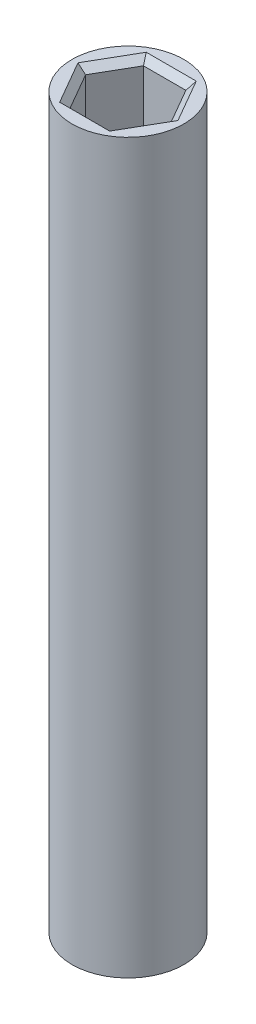
ISO-10303-21;
HEADER;
FILE_DESCRIPTION(('STEP AP214'),'2;1');
FILE_NAME('part.step','',(''),(''),'','','');
FILE_SCHEMA(('AUTOMOTIVE_DESIGN { 1 0 10303 214 1 1 1 1 }'));
ENDSEC;
DATA;
#1=APPLICATION_CONTEXT('core data for automotive mechanical design processes');
#2=APPLICATION_PROTOCOL_DEFINITION('international standard','automotive_design',2000,#1);
#3=PRODUCT_CONTEXT('',#1,'mechanical');
#4=PRODUCT('Part','Part','',(#3));
#5=PRODUCT_RELATED_PRODUCT_CATEGORY('part','',(#4));
#6=PRODUCT_DEFINITION_FORMATION('','',#4);
#7=PRODUCT_DEFINITION_CONTEXT('part definition',#1,'design');
#8=PRODUCT_DEFINITION('design','',#6,#7);
#9=PRODUCT_DEFINITION_SHAPE('','',#8);
#10=(LENGTH_UNIT() NAMED_UNIT(*) SI_UNIT(.MILLI.,.METRE.));
#11=(NAMED_UNIT(*) PLANE_ANGLE_UNIT() SI_UNIT($,.RADIAN.));
#12=(NAMED_UNIT(*) SI_UNIT($,.STERADIAN.) SOLID_ANGLE_UNIT());
#13=UNCERTAINTY_MEASURE_WITH_UNIT(LENGTH_MEASURE(1.E-05),#10,'distance_accuracy_value','');
#14=(GEOMETRIC_REPRESENTATION_CONTEXT(3) GLOBAL_UNCERTAINTY_ASSIGNED_CONTEXT((#13)) GLOBAL_UNIT_ASSIGNED_CONTEXT((#10,
#11,#12)) REPRESENTATION_CONTEXT('',''));
#15=CARTESIAN_POINT('',(0.,0.,0.));
#16=DIRECTION('',(0.,0.,1.));
#17=DIRECTION('',(1.,0.,0.));
#18=AXIS2_PLACEMENT_3D('',#15,#16,#17);
#19=CARTESIAN_POINT('',(0.,55.3238373,0.));
#20=DIRECTION('',(0.,-1.,0.));
#21=DIRECTION('',(0.,0.,-1.));
#22=AXIS2_PLACEMENT_3D('',#19,#20,#21);
#23=CYLINDRICAL_SURFACE('',#22,4.25);
#24=CARTESIAN_POINT('',(0.,55.3238373,0.));
#25=DIRECTION('',(0.,1.,0.));
#26=DIRECTION('',(0.,0.,1.));
#27=AXIS2_PLACEMENT_3D('',#24,#25,#26);
#28=CIRCLE('',#27,4.25);
#29=CARTESIAN_POINT('',(0.,55.3238373,4.25));
#30=VERTEX_POINT('',#29);
#31=EDGE_CURVE('E255',#30,#30,#28,.T.);
#32=ORIENTED_EDGE('',*,*,#31,.F.);
#33=EDGE_LOOP('',(#32));
#34=FACE_BOUND('',#33,.T.);
#35=CARTESIAN_POINT('',(0.,0.,0.));
#36=DIRECTION('',(0.,1.,0.));
#37=DIRECTION('',(0.,0.,1.));
#38=AXIS2_PLACEMENT_3D('',#35,#36,#37);
#39=CIRCLE('',#38,4.25);
#40=CARTESIAN_POINT('',(0.,0.,4.25));
#41=VERTEX_POINT('',#40);
#42=EDGE_CURVE('E240',#41,#41,#39,.T.);
#43=ORIENTED_EDGE('',*,*,#42,.T.);
#44=EDGE_LOOP('',(#43));
#45=FACE_BOUND('',#44,.T.);
#46=ADVANCED_FACE('F43',(#34,#45),#23,.T.);
#47=CARTESIAN_POINT('',(0.,55.3238373,0.));
#48=DIRECTION('',(0.,1.,0.));
#49=DIRECTION('',(0.,0.,1.));
#50=AXIS2_PLACEMENT_3D('',#47,#48,#49);
#51=PLANE('',#50);
#52=DIRECTION('',(-0.499999999999999,0.,0.866025403784439));
#53=VECTOR('',#52,1.);
#54=CARTESIAN_POINT('',(2.04381995293128,55.3238373,3.04));
#55=LINE('',#54,#53);
#56=CARTESIAN_POINT('',(3.79896477126774,55.3238373,0.));
#57=VERTEX_POINT('',#56);
#58=CARTESIAN_POINT('',(1.89948238563387,55.3238373,3.29));
#59=VERTEX_POINT('',#58);
#60=EDGE_CURVE('E271',#57,#59,#55,.T.);
#61=ORIENTED_EDGE('',*,*,#60,.T.);
#62=DIRECTION('',(-1.,0.,0.));
#63=VECTOR('',#62,1.);
#64=CARTESIAN_POINT('',(-1.61080725103905,55.3238373,3.29));
#65=LINE('',#64,#63);
#66=CARTESIAN_POINT('',(-1.89948238563387,55.3238373,3.29));
#67=VERTEX_POINT('',#66);
#68=EDGE_CURVE('E273',#59,#67,#65,.T.);
#69=ORIENTED_EDGE('',*,*,#68,.T.);
#70=DIRECTION('',(-0.5,0.,-0.866025403784439));
#71=VECTOR('',#70,1.);
#72=CARTESIAN_POINT('',(-3.65462720397033,55.3238373,0.250000000000003));
#73=LINE('',#72,#71);
#74=CARTESIAN_POINT('',(-3.79896477126774,55.3238373,0.));
#75=VERTEX_POINT('',#74);
#76=EDGE_CURVE('E265',#67,#75,#73,.T.);
#77=ORIENTED_EDGE('',*,*,#76,.T.);
#78=DIRECTION('',(0.5,0.,-0.866025403784439));
#79=VECTOR('',#78,1.);
#80=CARTESIAN_POINT('',(-2.04381995293128,55.3238373,-3.04));
#81=LINE('',#80,#79);
#82=CARTESIAN_POINT('',(-1.89948238563387,55.3238373,-3.29));
#83=VERTEX_POINT('',#82);
#84=EDGE_CURVE('E263',#75,#83,#81,.T.);
#85=ORIENTED_EDGE('',*,*,#84,.T.);
#86=DIRECTION('',(1.,0.,0.));
#87=VECTOR('',#86,1.);
#88=CARTESIAN_POINT('',(1.61080725103905,55.3238373,-3.29));
#89=LINE('',#88,#87);
#90=CARTESIAN_POINT('',(1.89948238563387,55.3238373,-3.29));
#91=VERTEX_POINT('',#90);
#92=EDGE_CURVE('E267',#83,#91,#89,.T.);
#93=ORIENTED_EDGE('',*,*,#92,.T.);
#94=DIRECTION('',(0.500000000000001,0.,0.866025403784438));
#95=VECTOR('',#94,1.);
#96=CARTESIAN_POINT('',(3.65462720397033,55.3238373,-0.250000000000004));
#97=LINE('',#96,#95);
#98=EDGE_CURVE('E269',#91,#57,#97,.T.);
#99=ORIENTED_EDGE('',*,*,#98,.T.);
#100=EDGE_LOOP('',(#61,#69,#77,#85,#93,#99));
#101=FACE_BOUND('',#100,.T.);
#102=ORIENTED_EDGE('',*,*,#31,.T.);
#103=EDGE_LOOP('',(#102));
#104=FACE_BOUND('',#103,.T.);
#105=ADVANCED_FACE('F365',(#101,#104),#51,.T.);
#106=CARTESIAN_POINT('',(0.,0.,0.));
#107=DIRECTION('',(0.,1.,0.));
#108=DIRECTION('',(0.,0.,1.));
#109=AXIS2_PLACEMENT_3D('',#106,#107,#108);
#110=PLANE('',#109);
#111=DIRECTION('',(0.866025403784439,0.,0.5));
#112=VECTOR('',#111,1.);
#113=CARTESIAN_POINT('',(-1.645,0.,2.8492235784508));
#114=LINE('',#113,#112);
#115=CARTESIAN_POINT('',(-3.29,0.,1.89948238563387));
#116=VERTEX_POINT('',#115);
#117=CARTESIAN_POINT('',(0.,0.,3.79896477126774));
#118=VERTEX_POINT('',#117);
#119=EDGE_CURVE('E309',#116,#118,#114,.T.);
#120=ORIENTED_EDGE('',*,*,#119,.T.);
#121=DIRECTION('',(0.866025403784439,0.,-0.5));
#122=VECTOR('',#121,1.);
#123=CARTESIAN_POINT('',(1.645,0.,2.8492235784508));
#124=LINE('',#123,#122);
#125=CARTESIAN_POINT('',(3.29,0.,1.89948238563387));
#126=VERTEX_POINT('',#125);
#127=EDGE_CURVE('E311',#118,#126,#124,.T.);
#128=ORIENTED_EDGE('',*,*,#127,.T.);
#129=DIRECTION('',(0.,0.,-1.));
#130=VECTOR('',#129,1.);
#131=CARTESIAN_POINT('',(3.29,0.,0.));
#132=LINE('',#131,#130);
#133=CARTESIAN_POINT('',(3.29,0.,-1.89948238563387));
#134=VERTEX_POINT('',#133);
#135=EDGE_CURVE('E301',#126,#134,#132,.T.);
#136=ORIENTED_EDGE('',*,*,#135,.T.);
#137=DIRECTION('',(-0.866025403784439,0.,-0.5));
#138=VECTOR('',#137,1.);
#139=CARTESIAN_POINT('',(1.645,0.,-2.8492235784508));
#140=LINE('',#139,#138);
#141=CARTESIAN_POINT('',(0.,0.,-3.79896477126774));
#142=VERTEX_POINT('',#141);
#143=EDGE_CURVE('E303',#134,#142,#140,.T.);
#144=ORIENTED_EDGE('',*,*,#143,.T.);
#145=DIRECTION('',(-0.866025403784439,0.,0.5));
#146=VECTOR('',#145,1.);
#147=CARTESIAN_POINT('',(-1.645,0.,-2.8492235784508));
#148=LINE('',#147,#146);
#149=CARTESIAN_POINT('',(-3.29,0.,-1.89948238563387));
#150=VERTEX_POINT('',#149);
#151=EDGE_CURVE('E305',#142,#150,#148,.T.);
#152=ORIENTED_EDGE('',*,*,#151,.T.);
#153=DIRECTION('',(0.,0.,1.));
#154=VECTOR('',#153,1.);
#155=CARTESIAN_POINT('',(-3.29,0.,0.));
#156=LINE('',#155,#154);
#157=EDGE_CURVE('E307',#150,#116,#156,.T.);
#158=ORIENTED_EDGE('',*,*,#157,.T.);
#159=EDGE_LOOP('',(#120,#128,#136,#144,#152,#158));
#160=FACE_BOUND('',#159,.T.);
#161=ORIENTED_EDGE('',*,*,#42,.F.);
#162=EDGE_LOOP('',(#161));
#163=FACE_BOUND('',#162,.T.);
#164=ADVANCED_FACE('F372',(#160,#163),#110,.F.);
#165=CARTESIAN_POINT('',(3.22161450207811,48.7238373,0.));
#166=DIRECTION('',(0.866025403784438,0.,-0.500000000000001));
#167=DIRECTION('',(-0.500000000000001,0.,-0.866025403784438));
#168=AXIS2_PLACEMENT_3D('',#165,#166,#167);
#169=PLANE('',#168);
#170=DIRECTION('',(0.,1.,0.));
#171=VECTOR('',#170,1.);
#172=CARTESIAN_POINT('',(3.22161450207811,48.7238373,0.));
#173=LINE('',#172,#171);
#174=CARTESIAN_POINT('',(3.22161450207811,48.7238373,0.));
#175=VERTEX_POINT('',#174);
#176=CARTESIAN_POINT('',(3.22161450207811,54.8238373,0.));
#177=VERTEX_POINT('',#176);
#178=EDGE_CURVE('E237',#175,#177,#173,.T.);
#179=ORIENTED_EDGE('',*,*,#178,.T.);
#180=DIRECTION('',(-0.500000000000001,0.,-0.866025403784438));
#181=VECTOR('',#180,1.);
#182=CARTESIAN_POINT('',(1.61080725103905,54.8238373,-2.79));
#183=LINE('',#182,#181);
#184=CARTESIAN_POINT('',(1.61080725103905,54.8238373,-2.79));
#185=VERTEX_POINT('',#184);
#186=EDGE_CURVE('E278',#177,#185,#183,.T.);
#187=ORIENTED_EDGE('',*,*,#186,.T.);
#188=DIRECTION('',(0.,1.,0.));
#189=VECTOR('',#188,1.);
#190=CARTESIAN_POINT('',(1.61080725103905,48.7238373,-2.79));
#191=LINE('',#190,#189);
#192=CARTESIAN_POINT('',(1.61080725103905,48.7238373,-2.79));
#193=VERTEX_POINT('',#192);
#194=EDGE_CURVE('E236',#193,#185,#191,.T.);
#195=ORIENTED_EDGE('',*,*,#194,.F.);
#196=DIRECTION('',(-0.500000000000001,0.,-0.866025403784438));
#197=VECTOR('',#196,1.);
#198=CARTESIAN_POINT('',(3.22161450207811,48.7238373,0.));
#199=LINE('',#198,#197);
#200=EDGE_CURVE('E217',#175,#193,#199,.T.);
#201=ORIENTED_EDGE('',*,*,#200,.F.);
#202=EDGE_LOOP('',(#179,#187,#195,#201));
#203=FACE_BOUND('',#202,.T.);
#204=ADVANCED_FACE('F613',(#203),#169,.F.);
#205=CARTESIAN_POINT('',(1.61080725103906,48.7238373,2.79));
#206=DIRECTION('',(0.866025403784439,0.,0.499999999999999));
#207=DIRECTION('',(0.499999999999999,0.,-0.866025403784439));
#208=AXIS2_PLACEMENT_3D('',#205,#206,#207);
#209=PLANE('',#208);
#210=DIRECTION('',(0.,1.,0.));
#211=VECTOR('',#210,1.);
#212=CARTESIAN_POINT('',(1.61080725103906,48.7238373,2.79));
#213=LINE('',#212,#211);
#214=CARTESIAN_POINT('',(1.61080725103906,48.7238373,2.79));
#215=VERTEX_POINT('',#214);
#216=CARTESIAN_POINT('',(1.61080725103906,54.8238373,2.79));
#217=VERTEX_POINT('',#216);
#218=EDGE_CURVE('E241',#215,#217,#213,.T.);
#219=ORIENTED_EDGE('',*,*,#218,.T.);
#220=DIRECTION('',(0.499999999999999,0.,-0.866025403784439));
#221=VECTOR('',#220,1.);
#222=CARTESIAN_POINT('',(3.22161450207811,54.8238373,0.));
#223=LINE('',#222,#221);
#224=EDGE_CURVE('E276',#217,#177,#223,.T.);
#225=ORIENTED_EDGE('',*,*,#224,.T.);
#226=ORIENTED_EDGE('',*,*,#178,.F.);
#227=DIRECTION('',(0.499999999999999,0.,-0.866025403784439));
#228=VECTOR('',#227,1.);
#229=CARTESIAN_POINT('',(1.61080725103906,48.7238373,2.79));
#230=LINE('',#229,#228);
#231=EDGE_CURVE('E233',#215,#175,#230,.T.);
#232=ORIENTED_EDGE('',*,*,#231,.F.);
#233=EDGE_LOOP('',(#219,#225,#226,#232));
#234=FACE_BOUND('',#233,.T.);
#235=ADVANCED_FACE('F604',(#234),#209,.F.);
#236=CARTESIAN_POINT('',(-1.61080725103905,48.7238373,2.79));
#237=DIRECTION('',(0.,0.,1.));
#238=DIRECTION('',(1.,0.,0.));
#239=AXIS2_PLACEMENT_3D('',#236,#237,#238);
#240=PLANE('',#239);
#241=DIRECTION('',(0.,1.,0.));
#242=VECTOR('',#241,1.);
#243=CARTESIAN_POINT('',(-1.61080725103905,48.7238373,2.79));
#244=LINE('',#243,#242);
#245=CARTESIAN_POINT('',(-1.61080725103905,48.7238373,2.79));
#246=VERTEX_POINT('',#245);
#247=CARTESIAN_POINT('',(-1.61080725103905,54.8238373,2.79));
#248=VERTEX_POINT('',#247);
#249=EDGE_CURVE('E244',#246,#248,#244,.T.);
#250=ORIENTED_EDGE('',*,*,#249,.T.);
#251=DIRECTION('',(1.,0.,0.));
#252=VECTOR('',#251,1.);
#253=CARTESIAN_POINT('',(1.61080725103906,54.8238373,2.79));
#254=LINE('',#253,#252);
#255=EDGE_CURVE('E258',#248,#217,#254,.T.);
#256=ORIENTED_EDGE('',*,*,#255,.T.);
#257=ORIENTED_EDGE('',*,*,#218,.F.);
#258=DIRECTION('',(1.,0.,0.));
#259=VECTOR('',#258,1.);
#260=CARTESIAN_POINT('',(-1.61080725103905,48.7238373,2.79));
#261=LINE('',#260,#259);
#262=EDGE_CURVE('E230',#246,#215,#261,.T.);
#263=ORIENTED_EDGE('',*,*,#262,.F.);
#264=EDGE_LOOP('',(#250,#256,#257,#263));
#265=FACE_BOUND('',#264,.T.);
#266=ADVANCED_FACE('F595',(#265),#240,.F.);
#267=CARTESIAN_POINT('',(-3.22161450207811,48.7238373,0.));
#268=DIRECTION('',(-0.866025403784438,0.,0.5));
#269=DIRECTION('',(0.5,0.,0.866025403784438));
#270=AXIS2_PLACEMENT_3D('',#267,#268,#269);
#271=PLANE('',#270);
#272=DIRECTION('',(0.,1.,0.));
#273=VECTOR('',#272,1.);
#274=CARTESIAN_POINT('',(-3.22161450207811,48.7238373,0.));
#275=LINE('',#274,#273);
#276=CARTESIAN_POINT('',(-3.22161450207811,48.7238373,0.));
#277=VERTEX_POINT('',#276);
#278=CARTESIAN_POINT('',(-3.22161450207811,54.8238373,0.));
#279=VERTEX_POINT('',#278);
#280=EDGE_CURVE('E247',#277,#279,#275,.T.);
#281=ORIENTED_EDGE('',*,*,#280,.T.);
#282=DIRECTION('',(0.5,0.,0.866025403784438));
#283=VECTOR('',#282,1.);
#284=CARTESIAN_POINT('',(-1.61080725103905,54.8238373,2.79));
#285=LINE('',#284,#283);
#286=EDGE_CURVE('E282',#279,#248,#285,.T.);
#287=ORIENTED_EDGE('',*,*,#286,.T.);
#288=ORIENTED_EDGE('',*,*,#249,.F.);
#289=DIRECTION('',(0.5,0.,0.866025403784439));
#290=VECTOR('',#289,1.);
#291=CARTESIAN_POINT('',(-3.22161450207811,48.7238373,0.));
#292=LINE('',#291,#290);
#293=EDGE_CURVE('E227',#277,#246,#292,.T.);
#294=ORIENTED_EDGE('',*,*,#293,.F.);
#295=EDGE_LOOP('',(#281,#287,#288,#294));
#296=FACE_BOUND('',#295,.T.);
#297=ADVANCED_FACE('F586',(#296),#271,.F.);
#298=CARTESIAN_POINT('',(-1.61080725103906,48.7238373,-2.79));
#299=DIRECTION('',(-0.866025403784439,0.,-0.5));
#300=DIRECTION('',(-0.5,0.,0.866025403784439));
#301=AXIS2_PLACEMENT_3D('',#298,#299,#300);
#302=PLANE('',#301);
#303=DIRECTION('',(0.,1.,0.));
#304=VECTOR('',#303,1.);
#305=CARTESIAN_POINT('',(-1.61080725103906,48.7238373,-2.79));
#306=LINE('',#305,#304);
#307=CARTESIAN_POINT('',(-1.61080725103906,48.7238373,-2.79));
#308=VERTEX_POINT('',#307);
#309=CARTESIAN_POINT('',(-1.61080725103906,54.8238373,-2.79));
#310=VERTEX_POINT('',#309);
#311=EDGE_CURVE('E250',#308,#310,#306,.T.);
#312=ORIENTED_EDGE('',*,*,#311,.T.);
#313=DIRECTION('',(-0.5,0.,0.866025403784439));
#314=VECTOR('',#313,1.);
#315=CARTESIAN_POINT('',(-3.22161450207811,54.8238373,0.));
#316=LINE('',#315,#314);
#317=EDGE_CURVE('E284',#310,#279,#316,.T.);
#318=ORIENTED_EDGE('',*,*,#317,.T.);
#319=ORIENTED_EDGE('',*,*,#280,.F.);
#320=DIRECTION('',(-0.5,0.,0.866025403784439));
#321=VECTOR('',#320,1.);
#322=CARTESIAN_POINT('',(-1.61080725103906,48.7238373,-2.79));
#323=LINE('',#322,#321);
#324=EDGE_CURVE('E224',#308,#277,#323,.T.);
#325=ORIENTED_EDGE('',*,*,#324,.F.);
#326=EDGE_LOOP('',(#312,#318,#319,#325));
#327=FACE_BOUND('',#326,.T.);
#328=ADVANCED_FACE('F577',(#327),#302,.F.);
#329=CARTESIAN_POINT('',(1.61080725103905,48.7238373,-2.79));
#330=DIRECTION('',(0.,0.,-1.));
#331=DIRECTION('',(-1.,0.,0.));
#332=AXIS2_PLACEMENT_3D('',#329,#330,#331);
#333=PLANE('',#332);
#334=ORIENTED_EDGE('',*,*,#194,.T.);
#335=DIRECTION('',(-1.,0.,0.));
#336=VECTOR('',#335,1.);
#337=CARTESIAN_POINT('',(-1.61080725103906,54.8238373,-2.79));
#338=LINE('',#337,#336);
#339=EDGE_CURVE('E280',#185,#310,#338,.T.);
#340=ORIENTED_EDGE('',*,*,#339,.T.);
#341=ORIENTED_EDGE('',*,*,#311,.F.);
#342=DIRECTION('',(-1.,0.,0.));
#343=VECTOR('',#342,1.);
#344=CARTESIAN_POINT('',(1.61080725103905,48.7238373,-2.79));
#345=LINE('',#344,#343);
#346=EDGE_CURVE('E220',#193,#308,#345,.T.);
#347=ORIENTED_EDGE('',*,*,#346,.F.);
#348=EDGE_LOOP('',(#334,#340,#341,#347));
#349=FACE_BOUND('',#348,.T.);
#350=ADVANCED_FACE('F568',(#349),#333,.F.);
#351=CARTESIAN_POINT('',(0.,48.7238373,0.));
#352=DIRECTION('',(0.,1.,0.));
#353=DIRECTION('',(0.,0.,1.));
#354=AXIS2_PLACEMENT_3D('',#351,#352,#353);
#355=PLANE('',#354);
#356=ORIENTED_EDGE('',*,*,#200,.T.);
#357=ORIENTED_EDGE('',*,*,#346,.T.);
#358=ORIENTED_EDGE('',*,*,#324,.T.);
#359=ORIENTED_EDGE('',*,*,#293,.T.);
#360=ORIENTED_EDGE('',*,*,#262,.T.);
#361=ORIENTED_EDGE('',*,*,#231,.T.);
#362=EDGE_LOOP('',(#356,#357,#358,#359,#360,#361));
#363=FACE_BOUND('',#362,.T.);
#364=ADVANCED_FACE('F420',(#363),#355,.T.);
#365=CARTESIAN_POINT('',(1.61080725103905,54.8238373,-2.79));
#366=DIRECTION('',(0.,0.707106781186544,0.707106781186551));
#367=DIRECTION('',(1.,0.,0.));
#368=AXIS2_PLACEMENT_3D('',#365,#366,#367);
#369=PLANE('',#368);
#370=DIRECTION('',(0.377964473009225,0.654653670707981,-0.654653670707975));
#371=VECTOR('',#370,1.);
#372=CARTESIAN_POINT('',(1.15057660788504,54.0266944428571,-1.99285714285715));
#373=LINE('',#372,#371);
#374=EDGE_CURVE('E295',#91,#185,#373,.F.);
#375=ORIENTED_EDGE('',*,*,#374,.F.);
#376=ORIENTED_EDGE('',*,*,#92,.F.);
#377=DIRECTION('',(-0.377964473009225,0.654653670707981,-0.654653670707975));
#378=VECTOR('',#377,1.);
#379=CARTESIAN_POINT('',(-1.15057660788504,54.0266944428571,-1.99285714285715));
#380=LINE('',#379,#378);
#381=EDGE_CURVE('E221',#310,#83,#380,.T.);
#382=ORIENTED_EDGE('',*,*,#381,.F.);
#383=ORIENTED_EDGE('',*,*,#339,.F.);
#384=EDGE_LOOP('',(#375,#376,#382,#383));
#385=FACE_BOUND('',#384,.T.);
#386=ADVANCED_FACE('F414',(#385),#369,.T.);
#387=CARTESIAN_POINT('',(-1.61080725103906,54.8238373,-2.79));
#388=DIRECTION('',(0.612372435695798,0.707106781186544,0.353553390593275));
#389=DIRECTION('',(0.5,0.,-0.866025403784439));
#390=AXIS2_PLACEMENT_3D('',#387,#388,#389);
#391=PLANE('',#390);
#392=ORIENTED_EDGE('',*,*,#381,.T.);
#393=ORIENTED_EDGE('',*,*,#84,.F.);
#394=DIRECTION('',(0.755928946018451,-0.654653670707981,0.));
#395=VECTOR('',#394,1.);
#396=CARTESIAN_POINT('',(-3.22161450207811,54.8238373,0.));
#397=LINE('',#396,#395);
#398=EDGE_CURVE('E292',#279,#75,#397,.F.);
#399=ORIENTED_EDGE('',*,*,#398,.F.);
#400=ORIENTED_EDGE('',*,*,#317,.F.);
#401=EDGE_LOOP('',(#392,#393,#399,#400));
#402=FACE_BOUND('',#401,.T.);
#403=ADVANCED_FACE('F407',(#402),#391,.T.);
#404=CARTESIAN_POINT('',(3.22161450207811,54.8238373,0.));
#405=DIRECTION('',(-0.612372435695798,0.707106781186544,0.353553390593276));
#406=DIRECTION('',(0.500000000000001,0.,0.866025403784438));
#407=AXIS2_PLACEMENT_3D('',#404,#405,#406);
#408=PLANE('',#407);
#409=ORIENTED_EDGE('',*,*,#374,.T.);
#410=ORIENTED_EDGE('',*,*,#186,.F.);
#411=DIRECTION('',(0.755928946018451,0.654653670707981,0.));
#412=VECTOR('',#411,1.);
#413=CARTESIAN_POINT('',(2.30115321577009,54.0266944428571,0.));
#414=LINE('',#413,#412);
#415=EDGE_CURVE('E289',#57,#177,#414,.F.);
#416=ORIENTED_EDGE('',*,*,#415,.F.);
#417=ORIENTED_EDGE('',*,*,#98,.F.);
#418=EDGE_LOOP('',(#409,#410,#416,#417));
#419=FACE_BOUND('',#418,.T.);
#420=ADVANCED_FACE('F400',(#419),#408,.T.);
#421=CARTESIAN_POINT('',(-3.22161450207811,54.8238373,0.));
#422=DIRECTION('',(0.612372435695798,0.707106781186544,-0.353553390593276));
#423=DIRECTION('',(-0.5,0.,-0.866025403784438));
#424=AXIS2_PLACEMENT_3D('',#421,#422,#423);
#425=PLANE('',#424);
#426=ORIENTED_EDGE('',*,*,#398,.T.);
#427=ORIENTED_EDGE('',*,*,#76,.F.);
#428=DIRECTION('',(0.377964473009225,-0.654653670707981,-0.654653670707974));
#429=VECTOR('',#428,1.);
#430=CARTESIAN_POINT('',(-1.61080725103905,54.8238373,2.79));
#431=LINE('',#430,#429);
#432=EDGE_CURVE('E287',#248,#67,#431,.F.);
#433=ORIENTED_EDGE('',*,*,#432,.F.);
#434=ORIENTED_EDGE('',*,*,#286,.F.);
#435=EDGE_LOOP('',(#426,#427,#433,#434));
#436=FACE_BOUND('',#435,.T.);
#437=ADVANCED_FACE('F393',(#436),#425,.T.);
#438=CARTESIAN_POINT('',(1.61080725103906,54.8238373,2.79));
#439=DIRECTION('',(-0.612372435695798,0.707106781186544,-0.353553390593275));
#440=DIRECTION('',(-0.499999999999999,0.,0.866025403784439));
#441=AXIS2_PLACEMENT_3D('',#438,#439,#440);
#442=PLANE('',#441);
#443=ORIENTED_EDGE('',*,*,#415,.T.);
#444=ORIENTED_EDGE('',*,*,#224,.F.);
#445=DIRECTION('',(0.377964473009226,0.654653670707981,0.654653670707974));
#446=VECTOR('',#445,1.);
#447=CARTESIAN_POINT('',(1.15057660788504,54.0266944428571,1.99285714285715));
#448=LINE('',#447,#446);
#449=EDGE_CURVE('E209',#59,#217,#448,.F.);
#450=ORIENTED_EDGE('',*,*,#449,.F.);
#451=ORIENTED_EDGE('',*,*,#60,.F.);
#452=EDGE_LOOP('',(#443,#444,#450,#451));
#453=FACE_BOUND('',#452,.T.);
#454=ADVANCED_FACE('F386',(#453),#442,.T.);
#455=CARTESIAN_POINT('',(-1.61080725103905,54.8238373,2.79));
#456=DIRECTION('',(0.,0.707106781186544,-0.707106781186551));
#457=DIRECTION('',(-1.,0.,0.));
#458=AXIS2_PLACEMENT_3D('',#455,#456,#457);
#459=PLANE('',#458);
#460=ORIENTED_EDGE('',*,*,#432,.T.);
#461=ORIENTED_EDGE('',*,*,#68,.F.);
#462=ORIENTED_EDGE('',*,*,#449,.T.);
#463=ORIENTED_EDGE('',*,*,#255,.F.);
#464=EDGE_LOOP('',(#460,#461,#462,#463));
#465=FACE_BOUND('',#464,.T.);
#466=ADVANCED_FACE('F380',(#465),#459,.T.);
#467=CARTESIAN_POINT('',(2.79,6.6,1.61080725103906));
#468=DIRECTION('',(0.5,0.,0.866025403784439));
#469=DIRECTION('',(0.866025403784439,0.,-0.5));
#470=AXIS2_PLACEMENT_3D('',#467,#468,#469);
#471=PLANE('',#470);
#472=DIRECTION('',(0.,-1.,0.));
#473=VECTOR('',#472,1.);
#474=CARTESIAN_POINT('',(2.79,6.6,1.61080725103906));
#475=LINE('',#474,#473);
#476=CARTESIAN_POINT('',(2.79,6.6,1.61080725103906));
#477=VERTEX_POINT('',#476);
#478=CARTESIAN_POINT('',(2.79,0.5,1.61080725103906));
#479=VERTEX_POINT('',#478);
#480=EDGE_CURVE('E207',#477,#479,#475,.T.);
#481=ORIENTED_EDGE('',*,*,#480,.T.);
#482=DIRECTION('',(-0.866025403784439,0.,0.5));
#483=VECTOR('',#482,1.);
#484=CARTESIAN_POINT('',(2.79,0.5,1.61080725103906));
#485=LINE('',#484,#483);
#486=CARTESIAN_POINT('',(0.,0.5,3.22161450207811));
#487=VERTEX_POINT('',#486);
#488=EDGE_CURVE('E179',#479,#487,#485,.T.);
#489=ORIENTED_EDGE('',*,*,#488,.T.);
#490=DIRECTION('',(0.,-1.,0.));
#491=VECTOR('',#490,1.);
#492=CARTESIAN_POINT('',(0.,6.6,3.22161450207811));
#493=LINE('',#492,#491);
#494=CARTESIAN_POINT('',(0.,6.6,3.22161450207811));
#495=VERTEX_POINT('',#494);
#496=EDGE_CURVE('E171',#495,#487,#493,.T.);
#497=ORIENTED_EDGE('',*,*,#496,.F.);
#498=DIRECTION('',(-0.866025403784439,0.,0.5));
#499=VECTOR('',#498,1.);
#500=CARTESIAN_POINT('',(2.79,6.6,1.61080725103906));
#501=LINE('',#500,#499);
#502=EDGE_CURVE('E176',#477,#495,#501,.T.);
#503=ORIENTED_EDGE('',*,*,#502,.F.);
#504=EDGE_LOOP('',(#481,#489,#497,#503));
#505=FACE_BOUND('',#504,.T.);
#506=ADVANCED_FACE('F174',(#505),#471,.F.);
#507=CARTESIAN_POINT('',(2.79,6.6,-1.61080725103906));
#508=DIRECTION('',(1.,0.,0.));
#509=DIRECTION('',(0.,0.,-1.));
#510=AXIS2_PLACEMENT_3D('',#507,#508,#509);
#511=PLANE('',#510);
#512=DIRECTION('',(0.,-1.,0.));
#513=VECTOR('',#512,1.);
#514=CARTESIAN_POINT('',(2.79,6.6,-1.61080725103906));
#515=LINE('',#514,#513);
#516=CARTESIAN_POINT('',(2.79,6.6,-1.61080725103906));
#517=VERTEX_POINT('',#516);
#518=CARTESIAN_POINT('',(2.79,0.5,-1.61080725103906));
#519=VERTEX_POINT('',#518);
#520=EDGE_CURVE('E210',#517,#519,#515,.T.);
#521=ORIENTED_EDGE('',*,*,#520,.T.);
#522=DIRECTION('',(0.,0.,1.));
#523=VECTOR('',#522,1.);
#524=CARTESIAN_POINT('',(2.79,0.5,-1.61080725103906));
#525=LINE('',#524,#523);
#526=EDGE_CURVE('E11',#519,#479,#525,.T.);
#527=ORIENTED_EDGE('',*,*,#526,.T.);
#528=ORIENTED_EDGE('',*,*,#480,.F.);
#529=DIRECTION('',(0.,0.,1.));
#530=VECTOR('',#529,1.);
#531=CARTESIAN_POINT('',(2.79,6.6,-1.61080725103906));
#532=LINE('',#531,#530);
#533=EDGE_CURVE('E182',#517,#477,#532,.T.);
#534=ORIENTED_EDGE('',*,*,#533,.F.);
#535=EDGE_LOOP('',(#521,#527,#528,#534));
#536=FACE_BOUND('',#535,.T.);
#537=ADVANCED_FACE('F349',(#536),#511,.F.);
#538=CARTESIAN_POINT('',(0.,6.6,-3.22161450207811));
#539=DIRECTION('',(0.5,0.,-0.866025403784438));
#540=DIRECTION('',(-0.866025403784439,0.,-0.5));
#541=AXIS2_PLACEMENT_3D('',#538,#539,#540);
#542=PLANE('',#541);
#543=DIRECTION('',(0.,-1.,0.));
#544=VECTOR('',#543,1.);
#545=CARTESIAN_POINT('',(0.,6.6,-3.22161450207811));
#546=LINE('',#545,#544);
#547=CARTESIAN_POINT('',(0.,6.6,-3.22161450207811));
#548=VERTEX_POINT('',#547);
#549=CARTESIAN_POINT('',(0.,0.5,-3.22161450207811));
#550=VERTEX_POINT('',#549);
#551=EDGE_CURVE('E212',#548,#550,#546,.T.);
#552=ORIENTED_EDGE('',*,*,#551,.T.);
#553=DIRECTION('',(0.866025403784439,0.,0.5));
#554=VECTOR('',#553,1.);
#555=CARTESIAN_POINT('',(0.,0.5,-3.22161450207811));
#556=LINE('',#555,#554);
#557=EDGE_CURVE('E53',#550,#519,#556,.T.);
#558=ORIENTED_EDGE('',*,*,#557,.T.);
#559=ORIENTED_EDGE('',*,*,#520,.F.);
#560=DIRECTION('',(0.866025403784438,0.,0.5));
#561=VECTOR('',#560,1.);
#562=CARTESIAN_POINT('',(0.,6.6,-3.22161450207811));
#563=LINE('',#562,#561);
#564=EDGE_CURVE('E204',#548,#517,#563,.T.);
#565=ORIENTED_EDGE('',*,*,#564,.F.);
#566=EDGE_LOOP('',(#552,#558,#559,#565));
#567=FACE_BOUND('',#566,.T.);
#568=ADVANCED_FACE('F351',(#567),#542,.F.);
#569=CARTESIAN_POINT('',(-2.79,6.6,-1.61080725103906));
#570=DIRECTION('',(-0.5,0.,-0.866025403784439));
#571=DIRECTION('',(-0.866025403784439,0.,0.5));
#572=AXIS2_PLACEMENT_3D('',#569,#570,#571);
#573=PLANE('',#572);
#574=DIRECTION('',(0.,-1.,0.));
#575=VECTOR('',#574,1.);
#576=CARTESIAN_POINT('',(-2.79,6.6,-1.61080725103906));
#577=LINE('',#576,#575);
#578=CARTESIAN_POINT('',(-2.79,6.6,-1.61080725103906));
#579=VERTEX_POINT('',#578);
#580=CARTESIAN_POINT('',(-2.79,0.5,-1.61080725103906));
#581=VERTEX_POINT('',#580);
#582=EDGE_CURVE('E214',#579,#581,#577,.T.);
#583=ORIENTED_EDGE('',*,*,#582,.T.);
#584=DIRECTION('',(0.866025403784439,0.,-0.5));
#585=VECTOR('',#584,1.);
#586=CARTESIAN_POINT('',(-2.79,0.5,-1.61080725103906));
#587=LINE('',#586,#585);
#588=EDGE_CURVE('E68',#581,#550,#587,.T.);
#589=ORIENTED_EDGE('',*,*,#588,.T.);
#590=ORIENTED_EDGE('',*,*,#551,.F.);
#591=DIRECTION('',(0.866025403784439,0.,-0.5));
#592=VECTOR('',#591,1.);
#593=CARTESIAN_POINT('',(-2.79,6.6,-1.61080725103906));
#594=LINE('',#593,#592);
#595=EDGE_CURVE('E201',#579,#548,#594,.T.);
#596=ORIENTED_EDGE('',*,*,#595,.F.);
#597=EDGE_LOOP('',(#583,#589,#590,#596));
#598=FACE_BOUND('',#597,.T.);
#599=ADVANCED_FACE('F353',(#598),#573,.F.);
#600=CARTESIAN_POINT('',(-2.79,6.6,1.61080725103906));
#601=DIRECTION('',(-1.,0.,0.));
#602=DIRECTION('',(0.,0.,1.));
#603=AXIS2_PLACEMENT_3D('',#600,#601,#602);
#604=PLANE('',#603);
#605=DIRECTION('',(0.,-1.,0.));
#606=VECTOR('',#605,1.);
#607=CARTESIAN_POINT('',(-2.79,6.6,1.61080725103906));
#608=LINE('',#607,#606);
#609=CARTESIAN_POINT('',(-2.79,6.6,1.61080725103906));
#610=VERTEX_POINT('',#609);
#611=CARTESIAN_POINT('',(-2.79,0.5,1.61080725103906));
#612=VERTEX_POINT('',#611);
#613=EDGE_CURVE('E181',#610,#612,#608,.T.);
#614=ORIENTED_EDGE('',*,*,#613,.T.);
#615=DIRECTION('',(0.,0.,-1.));
#616=VECTOR('',#615,1.);
#617=CARTESIAN_POINT('',(-2.79,0.5,1.61080725103906));
#618=LINE('',#617,#616);
#619=EDGE_CURVE('E316',#612,#581,#618,.T.);
#620=ORIENTED_EDGE('',*,*,#619,.T.);
#621=ORIENTED_EDGE('',*,*,#582,.F.);
#622=DIRECTION('',(0.,0.,-1.));
#623=VECTOR('',#622,1.);
#624=CARTESIAN_POINT('',(-2.79,6.6,1.61080725103906));
#625=LINE('',#624,#623);
#626=EDGE_CURVE('E191',#610,#579,#625,.T.);
#627=ORIENTED_EDGE('',*,*,#626,.F.);
#628=EDGE_LOOP('',(#614,#620,#621,#627));
#629=FACE_BOUND('',#628,.T.);
#630=ADVANCED_FACE('F355',(#629),#604,.F.);
#631=CARTESIAN_POINT('',(0.,6.6,3.22161450207811));
#632=DIRECTION('',(-0.5,0.,0.866025403784439));
#633=DIRECTION('',(0.866025403784438,0.,0.5));
#634=AXIS2_PLACEMENT_3D('',#631,#632,#633);
#635=PLANE('',#634);
#636=ORIENTED_EDGE('',*,*,#496,.T.);
#637=DIRECTION('',(-0.866025403784438,0.,-0.5));
#638=VECTOR('',#637,1.);
#639=CARTESIAN_POINT('',(0.,0.5,3.22161450207811));
#640=LINE('',#639,#638);
#641=EDGE_CURVE('E314',#487,#612,#640,.T.);
#642=ORIENTED_EDGE('',*,*,#641,.T.);
#643=ORIENTED_EDGE('',*,*,#613,.F.);
#644=DIRECTION('',(-0.866025403784439,0.,-0.5));
#645=VECTOR('',#644,1.);
#646=CARTESIAN_POINT('',(0.,6.6,3.22161450207811));
#647=LINE('',#646,#645);
#648=EDGE_CURVE('E185',#495,#610,#647,.T.);
#649=ORIENTED_EDGE('',*,*,#648,.F.);
#650=EDGE_LOOP('',(#636,#642,#643,#649));
#651=FACE_BOUND('',#650,.T.);
#652=ADVANCED_FACE('F186',(#651),#635,.F.);
#653=CARTESIAN_POINT('',(0.,6.6,0.));
#654=DIRECTION('',(0.,-1.,0.));
#655=DIRECTION('',(0.,0.,-1.));
#656=AXIS2_PLACEMENT_3D('',#653,#654,#655);
#657=PLANE('',#656);
#658=ORIENTED_EDGE('',*,*,#502,.T.);
#659=ORIENTED_EDGE('',*,*,#648,.T.);
#660=ORIENTED_EDGE('',*,*,#626,.T.);
#661=ORIENTED_EDGE('',*,*,#595,.T.);
#662=ORIENTED_EDGE('',*,*,#564,.T.);
#663=ORIENTED_EDGE('',*,*,#533,.T.);
#664=EDGE_LOOP('',(#658,#659,#660,#661,#662,#663));
#665=FACE_BOUND('',#664,.T.);
#666=ADVANCED_FACE('F193',(#665),#657,.T.);
#667=CARTESIAN_POINT('',(-2.79,0.5,-1.61080725103906));
#668=DIRECTION('',(-0.353553390593273,0.707106781186548,-0.612372435695794));
#669=DIRECTION('',(0.866025403784439,0.,-0.5));
#670=AXIS2_PLACEMENT_3D('',#667,#668,#669);
#671=PLANE('',#670);
#672=DIRECTION('',(-0.654653670707977,-0.654653670707977,-0.377964473009228));
#673=VECTOR('',#672,1.);
#674=CARTESIAN_POINT('',(-1.99285714285714,1.29714285714286,-1.15057660788504));
#675=LINE('',#674,#673);
#676=EDGE_CURVE('E198',#150,#581,#675,.F.);
#677=ORIENTED_EDGE('',*,*,#676,.F.);
#678=ORIENTED_EDGE('',*,*,#151,.F.);
#679=DIRECTION('',(0.,-0.654653670707977,-0.755928946018454));
#680=VECTOR('',#679,1.);
#681=CARTESIAN_POINT('',(0.,1.29714285714286,-2.30115321577008));
#682=LINE('',#681,#680);
#683=EDGE_CURVE('E48',#550,#142,#682,.T.);
#684=ORIENTED_EDGE('',*,*,#683,.F.);
#685=ORIENTED_EDGE('',*,*,#588,.F.);
#686=EDGE_LOOP('',(#677,#678,#684,#685));
#687=FACE_BOUND('',#686,.T.);
#688=ADVANCED_FACE('F46',(#687),#671,.F.);
#689=CARTESIAN_POINT('',(0.,0.5,-3.22161450207811));
#690=DIRECTION('',(0.353553390593274,0.707106781186547,-0.612372435695795));
#691=DIRECTION('',(0.866025403784439,0.,0.5));
#692=AXIS2_PLACEMENT_3D('',#689,#690,#691);
#693=PLANE('',#692);
#694=ORIENTED_EDGE('',*,*,#683,.T.);
#695=ORIENTED_EDGE('',*,*,#143,.F.);
#696=DIRECTION('',(0.654653670707977,-0.654653670707977,-0.377964473009227));
#697=VECTOR('',#696,1.);
#698=CARTESIAN_POINT('',(1.99285714285714,1.29714285714286,-1.15057660788504));
#699=LINE('',#698,#697);
#700=EDGE_CURVE('E327',#519,#134,#699,.T.);
#701=ORIENTED_EDGE('',*,*,#700,.F.);
#702=ORIENTED_EDGE('',*,*,#557,.F.);
#703=EDGE_LOOP('',(#694,#695,#701,#702));
#704=FACE_BOUND('',#703,.T.);
#705=ADVANCED_FACE('F342',(#704),#693,.F.);
#706=CARTESIAN_POINT('',(-2.79,0.5,1.61080725103906));
#707=DIRECTION('',(-0.707106781186547,0.707106781186548,0.));
#708=DIRECTION('',(0.,0.,-1.));
#709=AXIS2_PLACEMENT_3D('',#706,#707,#708);
#710=PLANE('',#709);
#711=ORIENTED_EDGE('',*,*,#676,.T.);
#712=ORIENTED_EDGE('',*,*,#619,.F.);
#713=DIRECTION('',(-0.654653670707977,-0.654653670707977,0.377964473009228));
#714=VECTOR('',#713,1.);
#715=CARTESIAN_POINT('',(-1.99285714285714,1.29714285714286,1.15057660788504));
#716=LINE('',#715,#714);
#717=EDGE_CURVE('E324',#116,#612,#716,.F.);
#718=ORIENTED_EDGE('',*,*,#717,.F.);
#719=ORIENTED_EDGE('',*,*,#157,.F.);
#720=EDGE_LOOP('',(#711,#712,#718,#719));
#721=FACE_BOUND('',#720,.T.);
#722=ADVANCED_FACE('F334',(#721),#710,.F.);
#723=CARTESIAN_POINT('',(2.79,0.5,-1.61080725103906));
#724=DIRECTION('',(0.707106781186548,0.707106781186547,0.));
#725=DIRECTION('',(0.,0.,1.));
#726=AXIS2_PLACEMENT_3D('',#723,#724,#725);
#727=PLANE('',#726);
#728=ORIENTED_EDGE('',*,*,#700,.T.);
#729=ORIENTED_EDGE('',*,*,#135,.F.);
#730=DIRECTION('',(-0.654653670707977,0.654653670707977,-0.377964473009227));
#731=VECTOR('',#730,1.);
#732=CARTESIAN_POINT('',(2.79,0.5,1.61080725103906));
#733=LINE('',#732,#731);
#734=EDGE_CURVE('E322',#479,#126,#733,.F.);
#735=ORIENTED_EDGE('',*,*,#734,.F.);
#736=ORIENTED_EDGE('',*,*,#526,.F.);
#737=EDGE_LOOP('',(#728,#729,#735,#736));
#738=FACE_BOUND('',#737,.T.);
#739=ADVANCED_FACE('F347',(#738),#727,.F.);
#740=CARTESIAN_POINT('',(0.,0.5,3.22161450207811));
#741=DIRECTION('',(-0.353553390593274,0.707106781186548,0.612372435695794));
#742=DIRECTION('',(-0.866025403784438,0.,-0.5));
#743=AXIS2_PLACEMENT_3D('',#740,#741,#742);
#744=PLANE('',#743);
#745=ORIENTED_EDGE('',*,*,#717,.T.);
#746=ORIENTED_EDGE('',*,*,#641,.F.);
#747=DIRECTION('',(0.,-0.654653670707977,0.755928946018454));
#748=VECTOR('',#747,1.);
#749=CARTESIAN_POINT('',(0.,1.29714285714286,2.30115321577008));
#750=LINE('',#749,#748);
#751=EDGE_CURVE('E320',#118,#487,#750,.F.);
#752=ORIENTED_EDGE('',*,*,#751,.F.);
#753=ORIENTED_EDGE('',*,*,#119,.F.);
#754=EDGE_LOOP('',(#745,#746,#752,#753));
#755=FACE_BOUND('',#754,.T.);
#756=ADVANCED_FACE('F429',(#755),#744,.F.);
#757=CARTESIAN_POINT('',(2.79,0.5,1.61080725103906));
#758=DIRECTION('',(0.353553390593274,0.707106781186547,0.612372435695795));
#759=DIRECTION('',(-0.866025403784439,0.,0.5));
#760=AXIS2_PLACEMENT_3D('',#757,#758,#759);
#761=PLANE('',#760);
#762=ORIENTED_EDGE('',*,*,#734,.T.);
#763=ORIENTED_EDGE('',*,*,#127,.F.);
#764=ORIENTED_EDGE('',*,*,#751,.T.);
#765=ORIENTED_EDGE('',*,*,#488,.F.);
#766=EDGE_LOOP('',(#762,#763,#764,#765));
#767=FACE_BOUND('',#766,.T.);
#768=ADVANCED_FACE('F423',(#767),#761,.F.);
#769=CLOSED_SHELL('',(#46,#105,#164,#204,#235,#266,#297,#328,#350,#364,#386,#403,#420,#437,#454,
#466,#506,#537,#568,#599,#630,#652,#666,#688,#705,#722,#739,#756,#768));
#770=MANIFOLD_SOLID_BREP('B2',#769);
#771=ADVANCED_BREP_SHAPE_REPRESENTATION('',(#18,#770),#14);
#772=SHAPE_DEFINITION_REPRESENTATION(#9,#771);
ENDSEC;
END-ISO-10303-21;
